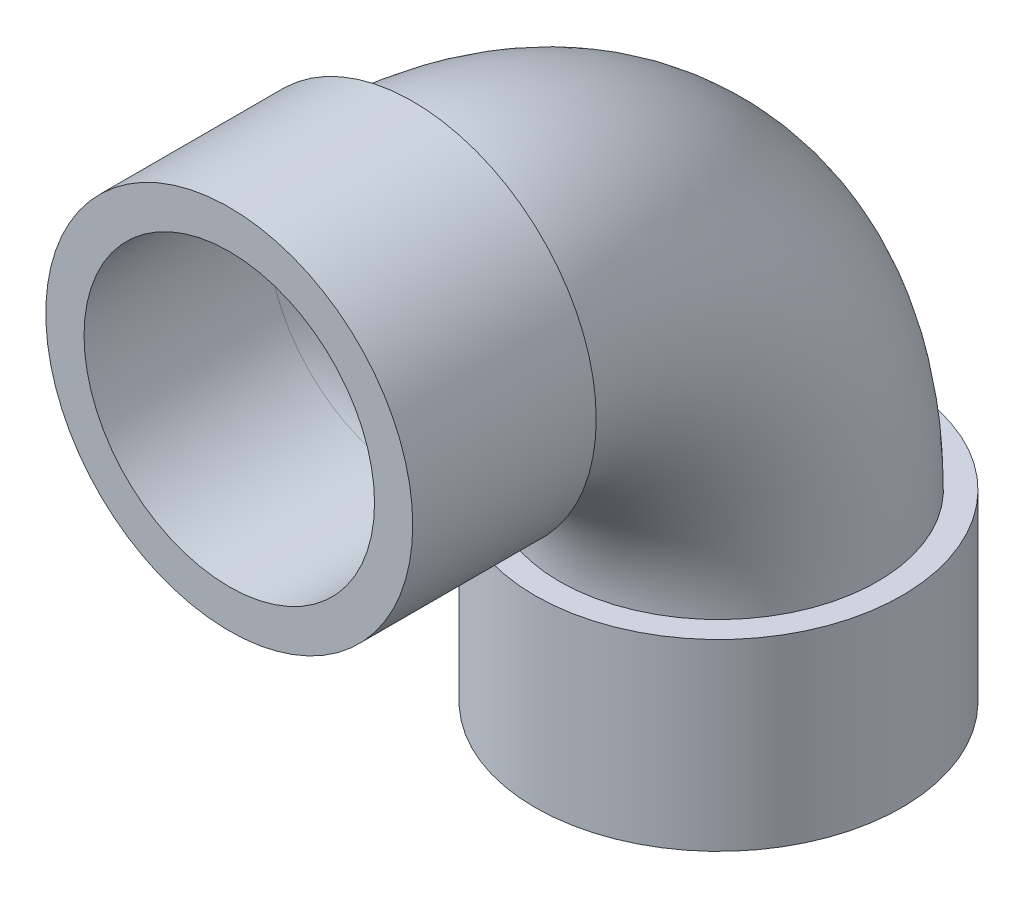
ISO-10303-21;
HEADER;
FILE_DESCRIPTION(('STEP AP214'),'2;1');
FILE_NAME('part.step','',(''),(''),'','','');
FILE_SCHEMA(('AUTOMOTIVE_DESIGN { 1 0 10303 214 1 1 1 1 }'));
ENDSEC;
DATA;
#1=APPLICATION_CONTEXT('core data for automotive mechanical design processes');
#2=APPLICATION_PROTOCOL_DEFINITION('international standard','automotive_design',2000,#1);
#3=PRODUCT_CONTEXT('',#1,'mechanical');
#4=PRODUCT('Part','Part','',(#3));
#5=PRODUCT_RELATED_PRODUCT_CATEGORY('part','',(#4));
#6=PRODUCT_DEFINITION_FORMATION('','',#4);
#7=PRODUCT_DEFINITION_CONTEXT('part definition',#1,'design');
#8=PRODUCT_DEFINITION('design','',#6,#7);
#9=PRODUCT_DEFINITION_SHAPE('','',#8);
#10=(LENGTH_UNIT() NAMED_UNIT(*) SI_UNIT(.MILLI.,.METRE.));
#11=(NAMED_UNIT(*) PLANE_ANGLE_UNIT() SI_UNIT($,.RADIAN.));
#12=(NAMED_UNIT(*) SI_UNIT($,.STERADIAN.) SOLID_ANGLE_UNIT());
#13=UNCERTAINTY_MEASURE_WITH_UNIT(LENGTH_MEASURE(1.E-05),#10,'distance_accuracy_value','');
#14=(GEOMETRIC_REPRESENTATION_CONTEXT(3) GLOBAL_UNCERTAINTY_ASSIGNED_CONTEXT((#13)) GLOBAL_UNIT_ASSIGNED_CONTEXT((#10,
#11,#12)) REPRESENTATION_CONTEXT('',''));
#15=CARTESIAN_POINT('',(0.,0.,0.));
#16=DIRECTION('',(0.,0.,1.));
#17=DIRECTION('',(1.,0.,0.));
#18=AXIS2_PLACEMENT_3D('',#15,#16,#17);
#19=CARTESIAN_POINT('',(0.,38.1,0.));
#20=DIRECTION('',(0.,1.,0.));
#21=DIRECTION('',(0.,0.,1.));
#22=AXIS2_PLACEMENT_3D('',#19,#20,#21);
#23=PLANE('',#22);
#24=CARTESIAN_POINT('',(0.,38.1,0.));
#25=DIRECTION('',(0.,1.,0.));
#26=DIRECTION('',(0.,0.,1.));
#27=AXIS2_PLACEMENT_3D('',#24,#25,#26);
#28=CIRCLE('',#27,33.02);
#29=CARTESIAN_POINT('',(0.,38.1,-33.02));
#30=VERTEX_POINT('',#29);
#31=EDGE_CURVE('E10',#30,#30,#28,.T.);
#32=ORIENTED_EDGE('',*,*,#31,.F.);
#33=EDGE_LOOP('',(#32));
#34=FACE_BOUND('',#33,.T.);
#35=CARTESIAN_POINT('',(0.,38.1,0.));
#36=DIRECTION('',(0.,1.,0.));
#37=DIRECTION('',(0.,0.,1.));
#38=AXIS2_PLACEMENT_3D('',#35,#36,#37);
#39=CIRCLE('',#38,38.1);
#40=CARTESIAN_POINT('',(0.,38.1,38.1));
#41=VERTEX_POINT('',#40);
#42=EDGE_CURVE('E46',#41,#41,#39,.T.);
#43=ORIENTED_EDGE('',*,*,#42,.T.);
#44=EDGE_LOOP('',(#43));
#45=FACE_BOUND('',#44,.T.);
#46=ADVANCED_FACE('F38',(#34,#45),#23,.T.);
#47=CARTESIAN_POINT('',(0.,0.,0.));
#48=DIRECTION('',(0.,1.,0.));
#49=DIRECTION('',(0.,0.,1.));
#50=AXIS2_PLACEMENT_3D('',#47,#48,#49);
#51=PLANE('',#50);
#52=CARTESIAN_POINT('',(0.,0.,0.));
#53=DIRECTION('',(0.,1.,0.));
#54=DIRECTION('',(0.,0.,1.));
#55=AXIS2_PLACEMENT_3D('',#52,#53,#54);
#56=CIRCLE('',#55,38.1);
#57=CARTESIAN_POINT('',(0.,0.,38.1));
#58=VERTEX_POINT('',#57);
#59=EDGE_CURVE('E42',#58,#58,#56,.T.);
#60=ORIENTED_EDGE('',*,*,#59,.F.);
#61=EDGE_LOOP('',(#60));
#62=FACE_BOUND('',#61,.T.);
#63=CARTESIAN_POINT('',(0.,0.,0.));
#64=DIRECTION('',(0.,1.,0.));
#65=DIRECTION('',(0.,0.,1.));
#66=AXIS2_PLACEMENT_3D('',#63,#64,#65);
#67=CIRCLE('',#66,30.1625);
#68=CARTESIAN_POINT('',(0.,0.,30.1625));
#69=VERTEX_POINT('',#68);
#70=EDGE_CURVE('E55',#69,#69,#67,.T.);
#71=ORIENTED_EDGE('',*,*,#70,.T.);
#72=EDGE_LOOP('',(#71));
#73=FACE_BOUND('',#72,.T.);
#74=ADVANCED_FACE('F102',(#62,#73),#51,.F.);
#75=CARTESIAN_POINT('',(0.,38.1,0.));
#76=DIRECTION('',(0.,-1.,0.));
#77=DIRECTION('',(0.,0.,-1.));
#78=AXIS2_PLACEMENT_3D('',#75,#76,#77);
#79=CYLINDRICAL_SURFACE('',#78,38.1);
#80=ORIENTED_EDGE('',*,*,#42,.F.);
#81=EDGE_LOOP('',(#80));
#82=FACE_BOUND('',#81,.T.);
#83=ORIENTED_EDGE('',*,*,#59,.T.);
#84=EDGE_LOOP('',(#83));
#85=FACE_BOUND('',#84,.T.);
#86=ADVANCED_FACE('F40',(#82,#85),#79,.T.);
#87=CARTESIAN_POINT('',(0.,38.1,0.));
#88=DIRECTION('',(0.,-1.,0.));
#89=DIRECTION('',(0.,0.,-1.));
#90=AXIS2_PLACEMENT_3D('',#87,#88,#89);
#91=CYLINDRICAL_SURFACE('',#90,30.1625);
#92=CARTESIAN_POINT('',(0.,38.1,0.));
#93=DIRECTION('',(0.,1.,0.));
#94=DIRECTION('',(0.,0.,1.));
#95=AXIS2_PLACEMENT_3D('',#92,#93,#94);
#96=CIRCLE('',#95,30.1625);
#97=CARTESIAN_POINT('',(0.,38.1,-30.1625));
#98=VERTEX_POINT('',#97);
#99=EDGE_CURVE('E62',#98,#98,#96,.F.);
#100=ORIENTED_EDGE('',*,*,#99,.F.);
#101=EDGE_LOOP('',(#100));
#102=FACE_BOUND('',#101,.T.);
#103=ORIENTED_EDGE('',*,*,#70,.F.);
#104=EDGE_LOOP('',(#103));
#105=FACE_BOUND('',#104,.T.);
#106=ADVANCED_FACE('F96',(#102,#105),#91,.F.);
#107=CARTESIAN_POINT('',(0.,38.1,63.5));
#108=DIRECTION('',(1.,0.,0.));
#109=DIRECTION('',(0.,0.,-1.));
#110=AXIS2_PLACEMENT_3D('',#107,#108,#109);
#111=TOROIDAL_SURFACE('',#110,63.5,33.02);
#112=CARTESIAN_POINT('',(0.,101.6,63.5));
#113=DIRECTION('',(0.,0.,1.));
#114=DIRECTION('',(0.,-1.,0.));
#115=AXIS2_PLACEMENT_3D('',#112,#113,#114);
#116=CIRCLE('',#115,33.02);
#117=CARTESIAN_POINT('',(0.,134.62,63.5));
#118=VERTEX_POINT('',#117);
#119=EDGE_CURVE('E53',#118,#118,#116,.T.);
#120=CARTESIAN_POINT('',(0.,38.1,63.5));
#121=DIRECTION('',(1.,0.,0.));
#122=DIRECTION('',(0.,0.,-1.));
#123=AXIS2_PLACEMENT_3D('',#120,#121,#122);
#124=CIRCLE('',#123,96.52);
#125=EDGE_CURVE('',#30,#118,#124,.T.);
#126=ORIENTED_EDGE('',*,*,#31,.T.);
#127=ORIENTED_EDGE('',*,*,#119,.F.);
#128=ORIENTED_EDGE('',*,*,#125,.T.);
#129=ORIENTED_EDGE('',*,*,#125,.F.);
#130=EDGE_LOOP('',(#126,#128,#127,#129));
#131=FACE_BOUND('',#130,.T.);
#132=ADVANCED_FACE('F86',(#131),#111,.T.);
#133=CARTESIAN_POINT('',(0.,38.1,63.5));
#134=DIRECTION('',(1.,0.,0.));
#135=DIRECTION('',(0.,0.,-1.));
#136=AXIS2_PLACEMENT_3D('',#133,#134,#135);
#137=TOROIDAL_SURFACE('',#136,63.5,30.1625);
#138=CARTESIAN_POINT('',(0.,101.6,63.5));
#139=DIRECTION('',(0.,0.,1.));
#140=DIRECTION('',(0.,-1.,0.));
#141=AXIS2_PLACEMENT_3D('',#138,#139,#140);
#142=CIRCLE('',#141,30.1625);
#143=CARTESIAN_POINT('',(0.,131.7625,63.5));
#144=VERTEX_POINT('',#143);
#145=EDGE_CURVE('E57',#144,#144,#142,.F.);
#146=CARTESIAN_POINT('',(0.,38.1,63.5));
#147=DIRECTION('',(1.,0.,0.));
#148=DIRECTION('',(0.,0.,-1.));
#149=AXIS2_PLACEMENT_3D('',#146,#147,#148);
#150=CIRCLE('',#149,93.6625);
#151=EDGE_CURVE('',#98,#144,#150,.T.);
#152=ORIENTED_EDGE('',*,*,#99,.T.);
#153=ORIENTED_EDGE('',*,*,#145,.F.);
#154=ORIENTED_EDGE('',*,*,#151,.T.);
#155=ORIENTED_EDGE('',*,*,#151,.F.);
#156=EDGE_LOOP('',(#152,#154,#153,#155));
#157=FACE_BOUND('',#156,.T.);
#158=ADVANCED_FACE('F83',(#157),#137,.F.);
#159=CARTESIAN_POINT('',(0.,101.6,101.6));
#160=DIRECTION('',(0.,0.,1.));
#161=DIRECTION('',(1.,0.,0.));
#162=AXIS2_PLACEMENT_3D('',#159,#160,#161);
#163=PLANE('',#162);
#164=CARTESIAN_POINT('',(0.,101.6,101.6));
#165=DIRECTION('',(0.,0.,1.));
#166=DIRECTION('',(1.,0.,0.));
#167=AXIS2_PLACEMENT_3D('',#164,#165,#166);
#168=CIRCLE('',#167,38.1);
#169=CARTESIAN_POINT('',(38.1,101.6,101.6));
#170=VERTEX_POINT('',#169);
#171=EDGE_CURVE('E71',#170,#170,#168,.T.);
#172=ORIENTED_EDGE('',*,*,#171,.T.);
#173=EDGE_LOOP('',(#172));
#174=FACE_BOUND('',#173,.T.);
#175=CARTESIAN_POINT('',(0.,101.6,101.6));
#176=DIRECTION('',(0.,0.,1.));
#177=DIRECTION('',(1.,0.,0.));
#178=AXIS2_PLACEMENT_3D('',#175,#176,#177);
#179=CIRCLE('',#178,30.1625);
#180=CARTESIAN_POINT('',(30.1625,101.6,101.6));
#181=VERTEX_POINT('',#180);
#182=EDGE_CURVE('E72',#181,#181,#179,.T.);
#183=ORIENTED_EDGE('',*,*,#182,.F.);
#184=EDGE_LOOP('',(#183));
#185=FACE_BOUND('',#184,.T.);
#186=ADVANCED_FACE('F80',(#174,#185),#163,.T.);
#187=CARTESIAN_POINT('',(0.,101.6,63.5));
#188=DIRECTION('',(0.,0.,1.));
#189=DIRECTION('',(1.,0.,0.));
#190=AXIS2_PLACEMENT_3D('',#187,#188,#189);
#191=PLANE('',#190);
#192=ORIENTED_EDGE('',*,*,#119,.T.);
#193=EDGE_LOOP('',(#192));
#194=FACE_BOUND('',#193,.T.);
#195=CARTESIAN_POINT('',(0.,101.6,63.5));
#196=DIRECTION('',(0.,0.,1.));
#197=DIRECTION('',(1.,0.,0.));
#198=AXIS2_PLACEMENT_3D('',#195,#196,#197);
#199=CIRCLE('',#198,38.1);
#200=CARTESIAN_POINT('',(38.1,101.6,63.5));
#201=VERTEX_POINT('',#200);
#202=EDGE_CURVE('E68',#201,#201,#199,.T.);
#203=ORIENTED_EDGE('',*,*,#202,.F.);
#204=EDGE_LOOP('',(#203));
#205=FACE_BOUND('',#204,.T.);
#206=ADVANCED_FACE('F82',(#194,#205),#191,.F.);
#207=CARTESIAN_POINT('',(0.,101.6,101.6));
#208=DIRECTION('',(0.,0.,-1.));
#209=DIRECTION('',(-1.,0.,0.));
#210=AXIS2_PLACEMENT_3D('',#207,#208,#209);
#211=CYLINDRICAL_SURFACE('',#210,38.1);
#212=ORIENTED_EDGE('',*,*,#171,.F.);
#213=EDGE_LOOP('',(#212));
#214=FACE_BOUND('',#213,.T.);
#215=ORIENTED_EDGE('',*,*,#202,.T.);
#216=EDGE_LOOP('',(#215));
#217=FACE_BOUND('',#216,.T.);
#218=ADVANCED_FACE('F91',(#214,#217),#211,.T.);
#219=CARTESIAN_POINT('',(0.,101.6,101.6));
#220=DIRECTION('',(0.,0.,-1.));
#221=DIRECTION('',(-1.,0.,0.));
#222=AXIS2_PLACEMENT_3D('',#219,#220,#221);
#223=CYLINDRICAL_SURFACE('',#222,30.1625);
#224=ORIENTED_EDGE('',*,*,#182,.T.);
#225=EDGE_LOOP('',(#224));
#226=FACE_BOUND('',#225,.T.);
#227=ORIENTED_EDGE('',*,*,#145,.T.);
#228=EDGE_LOOP('',(#227));
#229=FACE_BOUND('',#228,.T.);
#230=ADVANCED_FACE('F78',(#226,#229),#223,.F.);
#231=CLOSED_SHELL('',(#46,#74,#86,#106,#132,#158,#186,#206,#218,#230));
#232=MANIFOLD_SOLID_BREP('B2',#231);
#233=ADVANCED_BREP_SHAPE_REPRESENTATION('',(#18,#232),#14);
#234=SHAPE_DEFINITION_REPRESENTATION(#9,#233);
ENDSEC;
END-ISO-10303-21;
